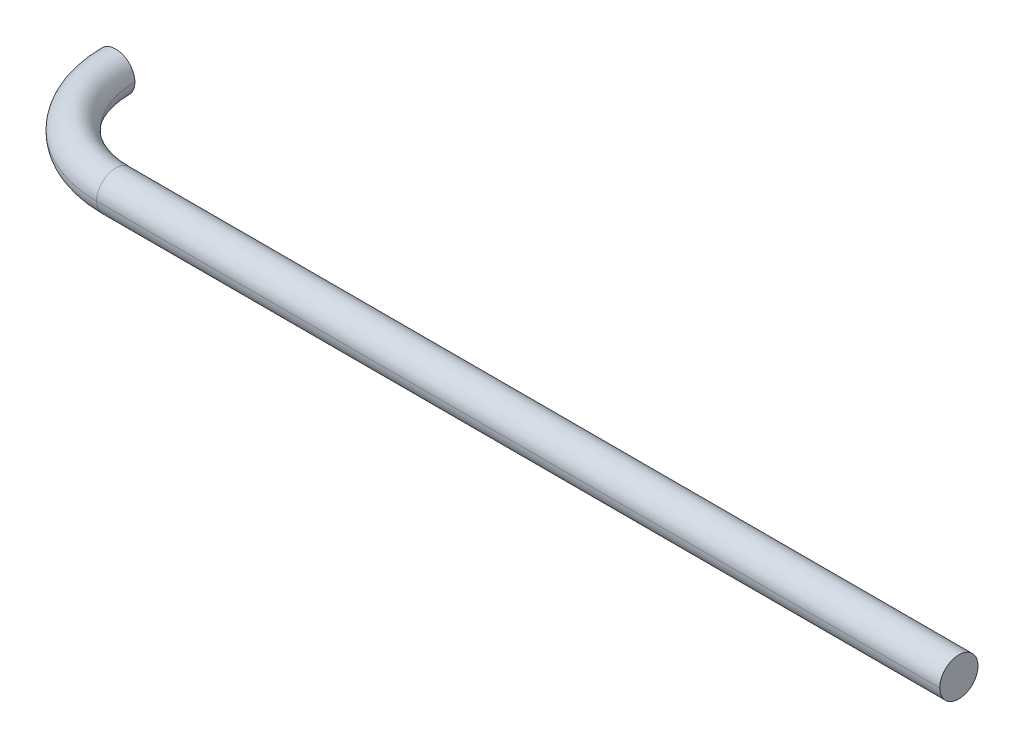
ISO-10303-21;
HEADER;
FILE_DESCRIPTION(('STEP AP214'),'2;1');
FILE_NAME('part.step','',(''),(''),'','','');
FILE_SCHEMA(('AUTOMOTIVE_DESIGN { 1 0 10303 214 1 1 1 1 }'));
ENDSEC;
DATA;
#1=APPLICATION_CONTEXT('core data for automotive mechanical design processes');
#2=APPLICATION_PROTOCOL_DEFINITION('international standard','automotive_design',2000,#1);
#3=PRODUCT_CONTEXT('',#1,'mechanical');
#4=PRODUCT('Part','Part','',(#3));
#5=PRODUCT_RELATED_PRODUCT_CATEGORY('part','',(#4));
#6=PRODUCT_DEFINITION_FORMATION('','',#4);
#7=PRODUCT_DEFINITION_CONTEXT('part definition',#1,'design');
#8=PRODUCT_DEFINITION('design','',#6,#7);
#9=PRODUCT_DEFINITION_SHAPE('','',#8);
#10=(LENGTH_UNIT() NAMED_UNIT(*) SI_UNIT(.MILLI.,.METRE.));
#11=(NAMED_UNIT(*) PLANE_ANGLE_UNIT() SI_UNIT($,.RADIAN.));
#12=(NAMED_UNIT(*) SI_UNIT($,.STERADIAN.) SOLID_ANGLE_UNIT());
#13=UNCERTAINTY_MEASURE_WITH_UNIT(LENGTH_MEASURE(1.E-05),#10,'distance_accuracy_value','');
#14=(GEOMETRIC_REPRESENTATION_CONTEXT(3) GLOBAL_UNCERTAINTY_ASSIGNED_CONTEXT((#13)) GLOBAL_UNIT_ASSIGNED_CONTEXT((#10,
#11,#12)) REPRESENTATION_CONTEXT('',''));
#15=CARTESIAN_POINT('',(0.,0.,0.));
#16=DIRECTION('',(0.,0.,1.));
#17=DIRECTION('',(1.,0.,0.));
#18=AXIS2_PLACEMENT_3D('',#15,#16,#17);
#19=CARTESIAN_POINT('',(3.4999999999986,0.,1.39727442019107E-12));
#20=DIRECTION('',(0.,1.,0.));
#21=DIRECTION('',(-1.,0.,-3.99221262911893E-13));
#22=AXIS2_PLACEMENT_3D('',#19,#20,#21);
#23=TOROIDAL_SURFACE('',#22,3.4999999999986,0.65);
#24=CARTESIAN_POINT('',(3.4999999999986,0.,1.39727442019107E-12));
#25=DIRECTION('',(0.,1.,0.));
#26=DIRECTION('',(0.,0.,1.));
#27=AXIS2_PLACEMENT_3D('',#24,#25,#26);
#28=CIRCLE('',#27,4.1499999999986);
#29=CARTESIAN_POINT('',(-0.65,0.,0.));
#30=VERTEX_POINT('',#29);
#31=CARTESIAN_POINT('',(3.49999999999748,0.,4.15));
#32=VERTEX_POINT('',#31);
#33=EDGE_CURVE('E81',#30,#32,#28,.T.);
#34=ORIENTED_EDGE('',*,*,#33,.F.);
#35=CARTESIAN_POINT('',(0.,0.,0.));
#36=DIRECTION('',(0.,0.,1.));
#37=DIRECTION('',(-1.,0.,0.));
#38=AXIS2_PLACEMENT_3D('',#35,#36,#37);
#39=CIRCLE('',#38,0.65);
#40=CARTESIAN_POINT('',(0.65,0.,0.));
#41=VERTEX_POINT('',#40);
#42=EDGE_CURVE('E28',#30,#41,#39,.T.);
#43=ORIENTED_EDGE('',*,*,#42,.T.);
#44=CARTESIAN_POINT('',(3.4999999999986,0.,1.39727442019107E-12));
#45=DIRECTION('',(0.,1.,0.));
#46=DIRECTION('',(0.,0.,1.));
#47=AXIS2_PLACEMENT_3D('',#44,#45,#46);
#48=CIRCLE('',#47,2.8499999999986);
#49=CARTESIAN_POINT('',(3.49999999999783,0.,2.85));
#50=VERTEX_POINT('',#49);
#51=EDGE_CURVE('E78',#41,#50,#48,.T.);
#52=ORIENTED_EDGE('',*,*,#51,.T.);
#53=CARTESIAN_POINT('',(3.49999999999765,0.,3.5));
#54=DIRECTION('',(1.,0.,2.71550944124062E-13));
#55=DIRECTION('',(-2.71550944124062E-13,0.,1.));
#56=AXIS2_PLACEMENT_3D('',#53,#54,#55);
#57=CIRCLE('',#56,0.65);
#58=EDGE_CURVE('E90',#32,#50,#57,.T.);
#59=ORIENTED_EDGE('',*,*,#58,.F.);
#60=EDGE_LOOP('',(#34,#43,#52,#59));
#61=FACE_BOUND('',#60,.T.);
#62=ADVANCED_FACE('F17',(#61),#23,.T.);
#63=CARTESIAN_POINT('',(3.49999999999765,0.,3.5));
#64=DIRECTION('',(1.,0.,0.));
#65=DIRECTION('',(0.,0.,1.));
#66=AXIS2_PLACEMENT_3D('',#63,#64,#65);
#67=CYLINDRICAL_SURFACE('',#66,0.65);
#68=DIRECTION('',(1.,0.,0.));
#69=VECTOR('',#68,1.);
#70=CARTESIAN_POINT('',(3.49999999999765,0.,2.85));
#71=LINE('',#70,#69);
#72=CARTESIAN_POINT('',(32.1389851691479,0.,2.85));
#73=VERTEX_POINT('',#72);
#74=EDGE_CURVE('E21',#50,#73,#71,.T.);
#75=ORIENTED_EDGE('',*,*,#74,.F.);
#76=CARTESIAN_POINT('',(3.49999999999765,0.,3.5));
#77=DIRECTION('',(1.,0.,2.71550944124062E-13));
#78=DIRECTION('',(-2.71550944124062E-13,0.,1.));
#79=AXIS2_PLACEMENT_3D('',#76,#77,#78);
#80=CIRCLE('',#79,0.65);
#81=EDGE_CURVE('E88',#50,#32,#80,.T.);
#82=ORIENTED_EDGE('',*,*,#81,.T.);
#83=DIRECTION('',(1.,0.,0.));
#84=VECTOR('',#83,1.);
#85=CARTESIAN_POINT('',(3.49999999999765,0.,4.15));
#86=LINE('',#85,#84);
#87=CARTESIAN_POINT('',(32.1389851691481,0.,4.15));
#88=VERTEX_POINT('',#87);
#89=EDGE_CURVE('E63',#32,#88,#86,.T.);
#90=ORIENTED_EDGE('',*,*,#89,.T.);
#91=CARTESIAN_POINT('',(32.138985169148,0.,3.5));
#92=DIRECTION('',(1.,0.,-1.28102656687518E-13));
#93=DIRECTION('',(1.28102656687518E-13,0.,1.));
#94=AXIS2_PLACEMENT_3D('',#91,#92,#93);
#95=CIRCLE('',#94,0.65);
#96=EDGE_CURVE('E11',#73,#88,#95,.T.);
#97=ORIENTED_EDGE('',*,*,#96,.F.);
#98=EDGE_LOOP('',(#75,#82,#90,#97));
#99=FACE_BOUND('',#98,.T.);
#100=ADVANCED_FACE('F113',(#99),#67,.T.);
#101=CARTESIAN_POINT('',(32.138985169148,0.,3.5));
#102=DIRECTION('',(1.,0.,-1.27491950812021E-13));
#103=DIRECTION('',(-1.27491950812021E-13,0.,-1.));
#104=AXIS2_PLACEMENT_3D('',#101,#102,#103);
#105=PLANE('',#104);
#106=CARTESIAN_POINT('',(32.138985169148,0.,3.5));
#107=DIRECTION('',(1.,0.,-1.28102656687518E-13));
#108=DIRECTION('',(1.28102656687518E-13,0.,1.));
#109=AXIS2_PLACEMENT_3D('',#106,#107,#108);
#110=CIRCLE('',#109,0.65);
#111=EDGE_CURVE('E104',#88,#73,#110,.T.);
#112=ORIENTED_EDGE('',*,*,#111,.T.);
#113=ORIENTED_EDGE('',*,*,#96,.T.);
#114=EDGE_LOOP('',(#112,#113));
#115=FACE_BOUND('',#114,.T.);
#116=ADVANCED_FACE('F115',(#115),#105,.T.);
#117=CARTESIAN_POINT('',(0.,0.,0.));
#118=DIRECTION('',(0.,0.,1.));
#119=DIRECTION('',(1.,0.,0.));
#120=AXIS2_PLACEMENT_3D('',#117,#118,#119);
#121=PLANE('',#120);
#122=CARTESIAN_POINT('',(0.,0.,0.));
#123=DIRECTION('',(0.,0.,1.));
#124=DIRECTION('',(-1.,0.,0.));
#125=AXIS2_PLACEMENT_3D('',#122,#123,#124);
#126=CIRCLE('',#125,0.65);
#127=EDGE_CURVE('E87',#41,#30,#126,.T.);
#128=ORIENTED_EDGE('',*,*,#127,.F.);
#129=ORIENTED_EDGE('',*,*,#42,.F.);
#130=EDGE_LOOP('',(#128,#129));
#131=FACE_BOUND('',#130,.T.);
#132=ADVANCED_FACE('F19',(#131),#121,.F.);
#133=CARTESIAN_POINT('',(3.49999999999765,0.,3.5));
#134=DIRECTION('',(1.,0.,0.));
#135=DIRECTION('',(0.,0.,1.));
#136=AXIS2_PLACEMENT_3D('',#133,#134,#135);
#137=CYLINDRICAL_SURFACE('',#136,0.65);
#138=ORIENTED_EDGE('',*,*,#58,.T.);
#139=ORIENTED_EDGE('',*,*,#74,.T.);
#140=ORIENTED_EDGE('',*,*,#111,.F.);
#141=ORIENTED_EDGE('',*,*,#89,.F.);
#142=EDGE_LOOP('',(#138,#139,#140,#141));
#143=FACE_BOUND('',#142,.T.);
#144=ADVANCED_FACE('F112',(#143),#137,.T.);
#145=CARTESIAN_POINT('',(3.4999999999986,0.,1.39727442019107E-12));
#146=DIRECTION('',(0.,1.,0.));
#147=DIRECTION('',(-1.,0.,-3.99221262911893E-13));
#148=AXIS2_PLACEMENT_3D('',#145,#146,#147);
#149=TOROIDAL_SURFACE('',#148,3.4999999999986,0.65);
#150=ORIENTED_EDGE('',*,*,#127,.T.);
#151=ORIENTED_EDGE('',*,*,#33,.T.);
#152=ORIENTED_EDGE('',*,*,#81,.F.);
#153=ORIENTED_EDGE('',*,*,#51,.F.);
#154=EDGE_LOOP('',(#150,#151,#152,#153));
#155=FACE_BOUND('',#154,.T.);
#156=ADVANCED_FACE('F86',(#155),#149,.T.);
#157=CLOSED_SHELL('',(#62,#100,#116,#132,#144,#156));
#158=MANIFOLD_SOLID_BREP('B1',#157);
#159=ADVANCED_BREP_SHAPE_REPRESENTATION('',(#18,#158),#14);
#160=SHAPE_DEFINITION_REPRESENTATION(#9,#159);
ENDSEC;
END-ISO-10303-21;
